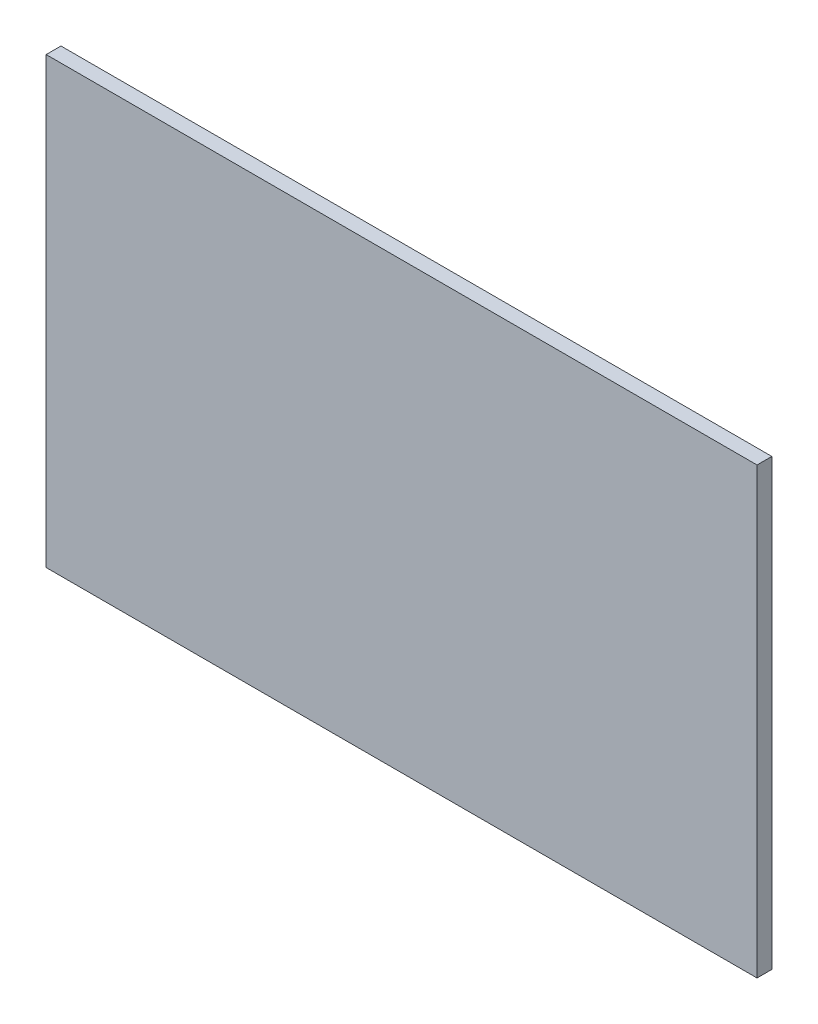
ISO-10303-21;
HEADER;
FILE_DESCRIPTION(('STEP AP214'),'2;1');
FILE_NAME('part.step','',(''),(''),'','','');
FILE_SCHEMA(('AUTOMOTIVE_DESIGN { 1 0 10303 214 1 1 1 1 }'));
ENDSEC;
DATA;
#1=APPLICATION_CONTEXT('core data for automotive mechanical design processes');
#2=APPLICATION_PROTOCOL_DEFINITION('international standard','automotive_design',2000,#1);
#3=PRODUCT_CONTEXT('',#1,'mechanical');
#4=PRODUCT('Part','Part','',(#3));
#5=PRODUCT_RELATED_PRODUCT_CATEGORY('part','',(#4));
#6=PRODUCT_DEFINITION_FORMATION('','',#4);
#7=PRODUCT_DEFINITION_CONTEXT('part definition',#1,'design');
#8=PRODUCT_DEFINITION('design','',#6,#7);
#9=PRODUCT_DEFINITION_SHAPE('','',#8);
#10=(LENGTH_UNIT() NAMED_UNIT(*) SI_UNIT(.MILLI.,.METRE.));
#11=(NAMED_UNIT(*) PLANE_ANGLE_UNIT() SI_UNIT($,.RADIAN.));
#12=(NAMED_UNIT(*) SI_UNIT($,.STERADIAN.) SOLID_ANGLE_UNIT());
#13=UNCERTAINTY_MEASURE_WITH_UNIT(LENGTH_MEASURE(1.E-05),#10,'distance_accuracy_value','');
#14=(GEOMETRIC_REPRESENTATION_CONTEXT(3) GLOBAL_UNCERTAINTY_ASSIGNED_CONTEXT((#13)) GLOBAL_UNIT_ASSIGNED_CONTEXT((#10,
#11,#12)) REPRESENTATION_CONTEXT('',''));
#15=CARTESIAN_POINT('',(0.,0.,0.));
#16=DIRECTION('',(0.,0.,1.));
#17=DIRECTION('',(1.,0.,0.));
#18=AXIS2_PLACEMENT_3D('',#15,#16,#17);
#19=CARTESIAN_POINT('',(120.,75.,5.));
#20=DIRECTION('',(-1.,0.,0.));
#21=DIRECTION('',(0.,-1.,0.));
#22=AXIS2_PLACEMENT_3D('',#19,#20,#21);
#23=PLANE('',#22);
#24=DIRECTION('',(0.,1.,0.));
#25=VECTOR('',#24,1.);
#26=CARTESIAN_POINT('',(120.,75.,0.));
#27=LINE('',#26,#25);
#28=CARTESIAN_POINT('',(120.,-75.,0.));
#29=VERTEX_POINT('',#28);
#30=CARTESIAN_POINT('',(120.,75.,0.));
#31=VERTEX_POINT('',#30);
#32=EDGE_CURVE('E107',#29,#31,#27,.T.);
#33=ORIENTED_EDGE('',*,*,#32,.T.);
#34=DIRECTION('',(0.,0.,-1.));
#35=VECTOR('',#34,1.);
#36=CARTESIAN_POINT('',(120.,75.,5.));
#37=LINE('',#36,#35);
#38=CARTESIAN_POINT('',(120.,75.,5.));
#39=VERTEX_POINT('',#38);
#40=EDGE_CURVE('E11',#39,#31,#37,.T.);
#41=ORIENTED_EDGE('',*,*,#40,.F.);
#42=DIRECTION('',(0.,1.,0.));
#43=VECTOR('',#42,1.);
#44=CARTESIAN_POINT('',(120.,75.,5.));
#45=LINE('',#44,#43);
#46=CARTESIAN_POINT('',(120.,-75.,5.));
#47=VERTEX_POINT('',#46);
#48=EDGE_CURVE('E91',#47,#39,#45,.T.);
#49=ORIENTED_EDGE('',*,*,#48,.F.);
#50=DIRECTION('',(0.,0.,-1.));
#51=VECTOR('',#50,1.);
#52=CARTESIAN_POINT('',(120.,-75.,5.));
#53=LINE('',#52,#51);
#54=EDGE_CURVE('E103',#47,#29,#53,.T.);
#55=ORIENTED_EDGE('',*,*,#54,.T.);
#56=EDGE_LOOP('',(#33,#41,#49,#55));
#57=FACE_BOUND('',#56,.T.);
#58=ADVANCED_FACE('F39',(#57),#23,.F.);
#59=CARTESIAN_POINT('',(-120.,75.,5.));
#60=DIRECTION('',(0.,-1.,0.));
#61=DIRECTION('',(0.,0.,-1.));
#62=AXIS2_PLACEMENT_3D('',#59,#60,#61);
#63=PLANE('',#62);
#64=DIRECTION('',(-1.,0.,0.));
#65=VECTOR('',#64,1.);
#66=CARTESIAN_POINT('',(-120.,75.,0.));
#67=LINE('',#66,#65);
#68=CARTESIAN_POINT('',(-120.,75.,0.));
#69=VERTEX_POINT('',#68);
#70=EDGE_CURVE('E96',#31,#69,#67,.T.);
#71=ORIENTED_EDGE('',*,*,#70,.T.);
#72=DIRECTION('',(0.,0.,-1.));
#73=VECTOR('',#72,1.);
#74=CARTESIAN_POINT('',(-120.,75.,5.));
#75=LINE('',#74,#73);
#76=CARTESIAN_POINT('',(-120.,75.,5.));
#77=VERTEX_POINT('',#76);
#78=EDGE_CURVE('E48',#77,#69,#75,.T.);
#79=ORIENTED_EDGE('',*,*,#78,.F.);
#80=DIRECTION('',(-1.,0.,0.));
#81=VECTOR('',#80,1.);
#82=CARTESIAN_POINT('',(-120.,75.,5.));
#83=LINE('',#82,#81);
#84=EDGE_CURVE('E86',#39,#77,#83,.T.);
#85=ORIENTED_EDGE('',*,*,#84,.F.);
#86=ORIENTED_EDGE('',*,*,#40,.T.);
#87=EDGE_LOOP('',(#71,#79,#85,#86));
#88=FACE_BOUND('',#87,.T.);
#89=ADVANCED_FACE('F95',(#88),#63,.F.);
#90=CARTESIAN_POINT('',(-120.,75.,5.));
#91=DIRECTION('',(1.,0.,0.));
#92=DIRECTION('',(0.,1.,0.));
#93=AXIS2_PLACEMENT_3D('',#90,#91,#92);
#94=PLANE('',#93);
#95=DIRECTION('',(0.,-1.,0.));
#96=VECTOR('',#95,1.);
#97=CARTESIAN_POINT('',(-120.,75.,0.));
#98=LINE('',#97,#96);
#99=CARTESIAN_POINT('',(-120.,-75.,0.));
#100=VERTEX_POINT('',#99);
#101=EDGE_CURVE('E73',#69,#100,#98,.T.);
#102=ORIENTED_EDGE('',*,*,#101,.T.);
#103=DIRECTION('',(0.,0.,-1.));
#104=VECTOR('',#103,1.);
#105=CARTESIAN_POINT('',(-120.,-75.,5.));
#106=LINE('',#105,#104);
#107=CARTESIAN_POINT('',(-120.,-75.,5.));
#108=VERTEX_POINT('',#107);
#109=EDGE_CURVE('E98',#108,#100,#106,.T.);
#110=ORIENTED_EDGE('',*,*,#109,.F.);
#111=DIRECTION('',(0.,-1.,0.));
#112=VECTOR('',#111,1.);
#113=CARTESIAN_POINT('',(-120.,75.,5.));
#114=LINE('',#113,#112);
#115=EDGE_CURVE('E89',#77,#108,#114,.T.);
#116=ORIENTED_EDGE('',*,*,#115,.F.);
#117=ORIENTED_EDGE('',*,*,#78,.T.);
#118=EDGE_LOOP('',(#102,#110,#116,#117));
#119=FACE_BOUND('',#118,.T.);
#120=ADVANCED_FACE('F99',(#119),#94,.F.);
#121=CARTESIAN_POINT('',(-120.,-75.,5.));
#122=DIRECTION('',(0.,1.,0.));
#123=DIRECTION('',(0.,0.,1.));
#124=AXIS2_PLACEMENT_3D('',#121,#122,#123);
#125=PLANE('',#124);
#126=DIRECTION('',(1.,0.,0.));
#127=VECTOR('',#126,1.);
#128=CARTESIAN_POINT('',(-120.,-75.,0.));
#129=LINE('',#128,#127);
#130=EDGE_CURVE('E79',#100,#29,#129,.T.);
#131=ORIENTED_EDGE('',*,*,#130,.T.);
#132=ORIENTED_EDGE('',*,*,#54,.F.);
#133=DIRECTION('',(1.,0.,0.));
#134=VECTOR('',#133,1.);
#135=CARTESIAN_POINT('',(-120.,-75.,5.));
#136=LINE('',#135,#134);
#137=EDGE_CURVE('E56',#108,#47,#136,.T.);
#138=ORIENTED_EDGE('',*,*,#137,.F.);
#139=ORIENTED_EDGE('',*,*,#109,.T.);
#140=EDGE_LOOP('',(#131,#132,#138,#139));
#141=FACE_BOUND('',#140,.T.);
#142=ADVANCED_FACE('F120',(#141),#125,.F.);
#143=CARTESIAN_POINT('',(0.,0.,5.));
#144=DIRECTION('',(0.,0.,1.));
#145=DIRECTION('',(1.,0.,0.));
#146=AXIS2_PLACEMENT_3D('',#143,#144,#145);
#147=PLANE('',#146);
#148=ORIENTED_EDGE('',*,*,#48,.T.);
#149=ORIENTED_EDGE('',*,*,#84,.T.);
#150=ORIENTED_EDGE('',*,*,#115,.T.);
#151=ORIENTED_EDGE('',*,*,#137,.T.);
#152=EDGE_LOOP('',(#148,#149,#150,#151));
#153=FACE_BOUND('',#152,.T.);
#154=ADVANCED_FACE('F87',(#153),#147,.T.);
#155=CARTESIAN_POINT('',(0.,0.,0.));
#156=DIRECTION('',(0.,0.,1.));
#157=DIRECTION('',(1.,0.,0.));
#158=AXIS2_PLACEMENT_3D('',#155,#156,#157);
#159=PLANE('',#158);
#160=ORIENTED_EDGE('',*,*,#32,.F.);
#161=ORIENTED_EDGE('',*,*,#130,.F.);
#162=ORIENTED_EDGE('',*,*,#101,.F.);
#163=ORIENTED_EDGE('',*,*,#70,.F.);
#164=EDGE_LOOP('',(#160,#161,#162,#163));
#165=FACE_BOUND('',#164,.T.);
#166=ADVANCED_FACE('F123',(#165),#159,.F.);
#167=CLOSED_SHELL('',(#58,#89,#120,#142,#154,#166));
#168=MANIFOLD_SOLID_BREP('B2',#167);
#169=ADVANCED_BREP_SHAPE_REPRESENTATION('',(#18,#168),#14);
#170=SHAPE_DEFINITION_REPRESENTATION(#9,#169);
ENDSEC;
END-ISO-10303-21;
